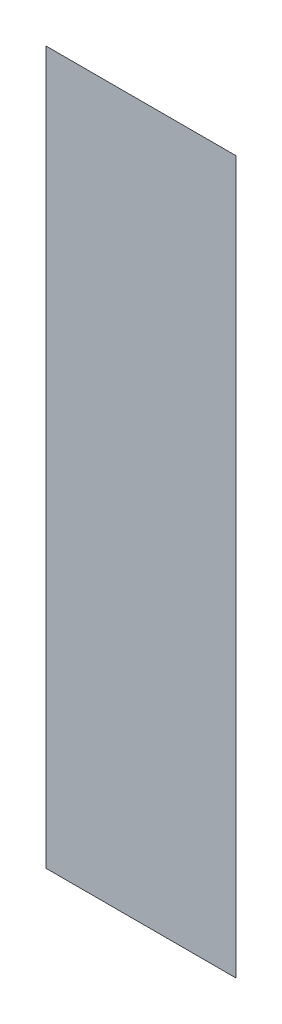
ISO-10303-21;
HEADER;
FILE_DESCRIPTION(('STEP AP214'),'2;1');
FILE_NAME('part.step','',(''),(''),'','','');
FILE_SCHEMA(('AUTOMOTIVE_DESIGN { 1 0 10303 214 1 1 1 1 }'));
ENDSEC;
DATA;
#1=APPLICATION_CONTEXT('core data for automotive mechanical design processes');
#2=APPLICATION_PROTOCOL_DEFINITION('international standard','automotive_design',2000,#1);
#3=PRODUCT_CONTEXT('',#1,'mechanical');
#4=PRODUCT('Part','Part','',(#3));
#5=PRODUCT_RELATED_PRODUCT_CATEGORY('part','',(#4));
#6=PRODUCT_DEFINITION_FORMATION('','',#4);
#7=PRODUCT_DEFINITION_CONTEXT('part definition',#1,'design');
#8=PRODUCT_DEFINITION('design','',#6,#7);
#9=PRODUCT_DEFINITION_SHAPE('','',#8);
#10=(LENGTH_UNIT() NAMED_UNIT(*) SI_UNIT(.MILLI.,.METRE.));
#11=(NAMED_UNIT(*) PLANE_ANGLE_UNIT() SI_UNIT($,.RADIAN.));
#12=(NAMED_UNIT(*) SI_UNIT($,.STERADIAN.) SOLID_ANGLE_UNIT());
#13=UNCERTAINTY_MEASURE_WITH_UNIT(LENGTH_MEASURE(1.E-05),#10,'distance_accuracy_value','');
#14=(GEOMETRIC_REPRESENTATION_CONTEXT(3) GLOBAL_UNCERTAINTY_ASSIGNED_CONTEXT((#13)) GLOBAL_UNIT_ASSIGNED_CONTEXT((#10,
#11,#12)) REPRESENTATION_CONTEXT('',''));
#15=CARTESIAN_POINT('',(0.,0.,0.));
#16=DIRECTION('',(0.,0.,1.));
#17=DIRECTION('',(1.,0.,0.));
#18=AXIS2_PLACEMENT_3D('',#15,#16,#17);
#19=CARTESIAN_POINT('',(0.851390104186754,-0.705826081203653,0.0889425196850394));
#20=DIRECTION('',(0.,0.,1.));
#21=DIRECTION('',(0.,-1.,0.));
#22=AXIS2_PLACEMENT_3D('',#19,#20,#21);
#23=PLANE('',#22);
#24=CARTESIAN_POINT('',(0.840807427021399,-0.70771584498318,0.0889425196850394));
#25=DIRECTION('',(1.,0.,0.));
#26=VECTOR('',#25,1.);
#27=LINE('',#24,#26);
#28=CARTESIAN_POINT('',(0.840807427021399,-0.70771584498318,0.0890685039370079));
#29=VERTEX_POINT('',#28);
#30=CARTESIAN_POINT('',(0.85088616717888,-0.70771584498318,0.0890685039370079));
#31=VERTEX_POINT('',#30);
#32=EDGE_CURVE('E50',#29,#31,#27,.T.);
#33=ORIENTED_EDGE('',*,*,#32,.T.);
#34=CARTESIAN_POINT('',(0.85088616717888,-0.70771584498318,0.0889425196850394));
#35=DIRECTION('',(0.,-1.,0.));
#36=VECTOR('',#35,1.);
#37=LINE('',#34,#36);
#38=CARTESIAN_POINT('',(0.85088616717888,-0.745511120573731,0.0890685039370079));
#39=VERTEX_POINT('',#38);
#40=EDGE_CURVE('E28',#31,#39,#37,.T.);
#41=ORIENTED_EDGE('',*,*,#40,.T.);
#42=CARTESIAN_POINT('',(0.85088616717888,-0.745511120573731,0.0889425196850394));
#43=DIRECTION('',(-1.,0.,0.));
#44=VECTOR('',#43,1.);
#45=LINE('',#42,#44);
#46=CARTESIAN_POINT('',(0.840807427021399,-0.745511120573731,0.0890685039370079));
#47=VERTEX_POINT('',#46);
#48=EDGE_CURVE('E11',#39,#47,#45,.T.);
#49=ORIENTED_EDGE('',*,*,#48,.T.);
#50=CARTESIAN_POINT('',(0.840807427021399,-0.745511120573731,0.0889425196850394));
#51=DIRECTION('',(0.,1.,0.));
#52=VECTOR('',#51,1.);
#53=LINE('',#50,#52);
#54=EDGE_CURVE('E41',#47,#29,#53,.T.);
#55=ORIENTED_EDGE('',*,*,#54,.T.);
#56=EDGE_LOOP('',(#33,#41,#49,#55));
#57=FACE_BOUND('',#56,.T.);
#58=ADVANCED_FACE('F17',(#57),#23,.F.);
#59=CARTESIAN_POINT('',(0.851390104186754,-0.705826081203653,0.0891944881889764));
#60=DIRECTION('',(0.,0.,1.));
#61=DIRECTION('',(0.,-1.,0.));
#62=AXIS2_PLACEMENT_3D('',#59,#60,#61);
#63=PLANE('',#62);
#64=ORIENTED_EDGE('',*,*,#40,.F.);
#65=ORIENTED_EDGE('',*,*,#32,.F.);
#66=ORIENTED_EDGE('',*,*,#54,.F.);
#67=ORIENTED_EDGE('',*,*,#48,.F.);
#68=EDGE_LOOP('',(#64,#65,#66,#67));
#69=FACE_BOUND('',#68,.T.);
#70=ADVANCED_FACE('F49',(#69),#63,.T.);
#71=CLOSED_SHELL('',(#58,#70));
#72=MANIFOLD_SOLID_BREP('B1',#71);
#73=ADVANCED_BREP_SHAPE_REPRESENTATION('',(#18,#72),#14);
#74=SHAPE_DEFINITION_REPRESENTATION(#9,#73);
ENDSEC;
END-ISO-10303-21;
